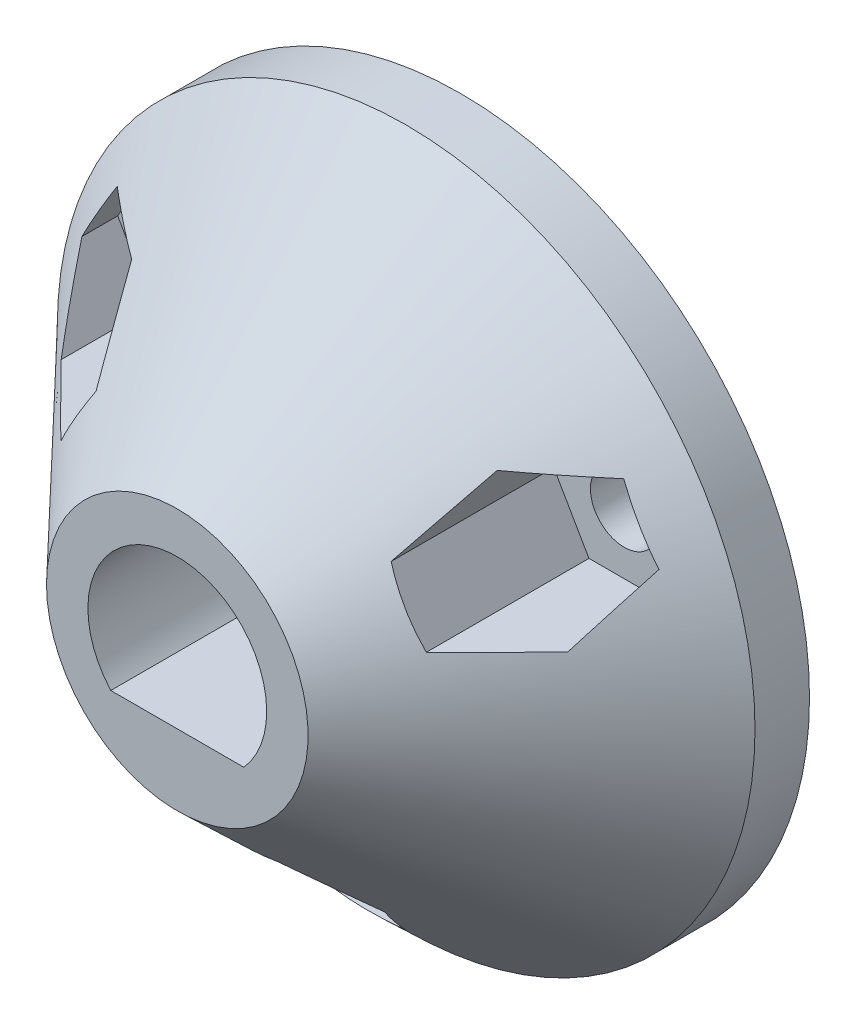
ISO-10303-21;
HEADER;
FILE_DESCRIPTION(('STEP AP214'),'2;1');
FILE_NAME('part.step','',(''),(''),'','','');
FILE_SCHEMA(('AUTOMOTIVE_DESIGN { 1 0 10303 214 1 1 1 1 }'));
ENDSEC;
DATA;
#1=APPLICATION_CONTEXT('core data for automotive mechanical design processes');
#2=APPLICATION_PROTOCOL_DEFINITION('international standard','automotive_design',2000,#1);
#3=PRODUCT_CONTEXT('',#1,'mechanical');
#4=PRODUCT('Part','Part','',(#3));
#5=PRODUCT_RELATED_PRODUCT_CATEGORY('part','',(#4));
#6=PRODUCT_DEFINITION_FORMATION('','',#4);
#7=PRODUCT_DEFINITION_CONTEXT('part definition',#1,'design');
#8=PRODUCT_DEFINITION('design','',#6,#7);
#9=PRODUCT_DEFINITION_SHAPE('','',#8);
#10=(LENGTH_UNIT() NAMED_UNIT(*) SI_UNIT(.MILLI.,.METRE.));
#11=(NAMED_UNIT(*) PLANE_ANGLE_UNIT() SI_UNIT($,.RADIAN.));
#12=(NAMED_UNIT(*) SI_UNIT($,.STERADIAN.) SOLID_ANGLE_UNIT());
#13=UNCERTAINTY_MEASURE_WITH_UNIT(LENGTH_MEASURE(1.E-05),#10,'distance_accuracy_value','');
#14=(GEOMETRIC_REPRESENTATION_CONTEXT(3) GLOBAL_UNCERTAINTY_ASSIGNED_CONTEXT((#13)) GLOBAL_UNIT_ASSIGNED_CONTEXT((#10,
#11,#12)) REPRESENTATION_CONTEXT('',''));
#15=CARTESIAN_POINT('',(0.,0.,0.));
#16=DIRECTION('',(0.,0.,1.));
#17=DIRECTION('',(1.,0.,0.));
#18=AXIS2_PLACEMENT_3D('',#15,#16,#17);
#19=CARTESIAN_POINT('',(0.,0.,1.25));
#20=DIRECTION('',(0.,0.,1.));
#21=DIRECTION('',(1.,0.,0.));
#22=AXIS2_PLACEMENT_3D('',#19,#20,#21);
#23=CYLINDRICAL_SURFACE('',#22,16.);
#24=CARTESIAN_POINT('',(0.,0.,2.5));
#25=DIRECTION('',(0.,0.,1.));
#26=DIRECTION('',(1.,0.,0.));
#27=AXIS2_PLACEMENT_3D('',#24,#25,#26);
#28=CIRCLE('',#27,16.);
#29=CARTESIAN_POINT('',(-16.,0.,2.5));
#30=VERTEX_POINT('',#29);
#31=EDGE_CURVE('E494',#30,#30,#28,.T.);
#32=ORIENTED_EDGE('',*,*,#31,.F.);
#33=DIRECTION('',(0.,0.,-1.));
#34=VECTOR('',#33,1.);
#35=CARTESIAN_POINT('',(-16.,0.,1.25));
#36=LINE('',#35,#34);
#37=CARTESIAN_POINT('',(-16.,0.,0.));
#38=VERTEX_POINT('',#37);
#39=EDGE_CURVE('E10',#30,#38,#36,.T.);
#40=ORIENTED_EDGE('',*,*,#39,.T.);
#41=CARTESIAN_POINT('',(0.,0.,0.));
#42=DIRECTION('',(0.,0.,1.));
#43=DIRECTION('',(1.,0.,0.));
#44=AXIS2_PLACEMENT_3D('',#41,#42,#43);
#45=CIRCLE('',#44,16.);
#46=EDGE_CURVE('E20',#38,#38,#45,.T.);
#47=ORIENTED_EDGE('',*,*,#46,.T.);
#48=ORIENTED_EDGE('',*,*,#39,.F.);
#49=EDGE_LOOP('',(#32,#40,#47,#48));
#50=FACE_BOUND('',#49,.T.);
#51=ADVANCED_FACE('F16',(#50),#23,.T.);
#52=CARTESIAN_POINT('',(16.,0.,0.));
#53=DIRECTION('',(0.,0.,-1.));
#54=DIRECTION('',(0.,-1.,0.));
#55=AXIS2_PLACEMENT_3D('',#52,#53,#54);
#56=PLANE('',#55);
#57=CARTESIAN_POINT('',(-10.,5.77350269189625,0.));
#58=DIRECTION('',(0.,0.,1.));
#59=DIRECTION('',(1.,0.,0.));
#60=AXIS2_PLACEMENT_3D('',#57,#58,#59);
#61=CIRCLE('',#60,1.55);
#62=CARTESIAN_POINT('',(-11.55,5.77350269189625,0.));
#63=VERTEX_POINT('',#62);
#64=EDGE_CURVE('E293',#63,#63,#61,.T.);
#65=ORIENTED_EDGE('',*,*,#64,.T.);
#66=EDGE_LOOP('',(#65));
#67=FACE_BOUND('',#66,.T.);
#68=CARTESIAN_POINT('',(10.,5.77350269189625,0.));
#69=DIRECTION('',(0.,0.,1.));
#70=DIRECTION('',(1.,0.,0.));
#71=AXIS2_PLACEMENT_3D('',#68,#69,#70);
#72=CIRCLE('',#71,1.55);
#73=CARTESIAN_POINT('',(8.45,5.77350269189625,0.));
#74=VERTEX_POINT('',#73);
#75=EDGE_CURVE('E294',#74,#74,#72,.T.);
#76=ORIENTED_EDGE('',*,*,#75,.T.);
#77=EDGE_LOOP('',(#76));
#78=FACE_BOUND('',#77,.T.);
#79=CARTESIAN_POINT('',(0.,-11.5470053837925,0.));
#80=DIRECTION('',(0.,0.,1.));
#81=DIRECTION('',(1.,0.,0.));
#82=AXIS2_PLACEMENT_3D('',#79,#80,#81);
#83=CIRCLE('',#82,1.55);
#84=CARTESIAN_POINT('',(-1.55,-11.5470053837925,0.));
#85=VERTEX_POINT('',#84);
#86=EDGE_CURVE('E474',#85,#85,#83,.T.);
#87=ORIENTED_EDGE('',*,*,#86,.T.);
#88=EDGE_LOOP('',(#87));
#89=FACE_BOUND('',#88,.T.);
#90=CARTESIAN_POINT('',(0.,0.,0.));
#91=DIRECTION('',(0.,0.,1.));
#92=DIRECTION('',(-1.,0.,0.));
#93=AXIS2_PLACEMENT_3D('',#90,#91,#92);
#94=CIRCLE('',#93,4.1);
#95=CARTESIAN_POINT('',(3.05,-2.73998175176405,0.));
#96=VERTEX_POINT('',#95);
#97=CARTESIAN_POINT('',(-3.05,-2.73998175176405,0.));
#98=VERTEX_POINT('',#97);
#99=EDGE_CURVE('E522',#96,#98,#94,.T.);
#100=ORIENTED_EDGE('',*,*,#99,.T.);
#101=DIRECTION('',(1.,0.,0.));
#102=VECTOR('',#101,1.);
#103=CARTESIAN_POINT('',(9.525,-2.73998175176405,0.));
#104=LINE('',#103,#102);
#105=EDGE_CURVE('E523',#98,#96,#104,.T.);
#106=ORIENTED_EDGE('',*,*,#105,.T.);
#107=EDGE_LOOP('',(#100,#106));
#108=FACE_BOUND('',#107,.T.);
#109=ORIENTED_EDGE('',*,*,#46,.F.);
#110=EDGE_LOOP('',(#109));
#111=FACE_BOUND('',#110,.T.);
#112=ADVANCED_FACE('F18',(#67,#78,#89,#108,#111),#56,.T.);
#113=CARTESIAN_POINT('',(0.,0.,13.));
#114=DIRECTION('',(0.,0.,1.));
#115=DIRECTION('',(1.,0.,0.));
#116=AXIS2_PLACEMENT_3D('',#113,#114,#115);
#117=PLANE('',#116);
#118=CARTESIAN_POINT('',(0.,0.,13.));
#119=DIRECTION('',(0.,0.,-1.));
#120=DIRECTION('',(-1.,0.,0.));
#121=AXIS2_PLACEMENT_3D('',#118,#119,#120);
#122=CIRCLE('',#121,4.1);
#123=CARTESIAN_POINT('',(-3.05,-2.73998175176405,13.));
#124=VERTEX_POINT('',#123);
#125=CARTESIAN_POINT('',(3.05,-2.73998175176405,13.));
#126=VERTEX_POINT('',#125);
#127=EDGE_CURVE('E534',#124,#126,#122,.T.);
#128=ORIENTED_EDGE('',*,*,#127,.T.);
#129=DIRECTION('',(-1.,0.,0.));
#130=VECTOR('',#129,1.);
#131=CARTESIAN_POINT('',(1.525,-2.73998175176405,13.));
#132=LINE('',#131,#130);
#133=EDGE_CURVE('E574',#126,#124,#132,.T.);
#134=ORIENTED_EDGE('',*,*,#133,.T.);
#135=EDGE_LOOP('',(#128,#134));
#136=FACE_BOUND('',#135,.T.);
#137=CARTESIAN_POINT('',(0.,0.,13.));
#138=DIRECTION('',(0.,0.,1.));
#139=DIRECTION('',(1.,0.,0.));
#140=AXIS2_PLACEMENT_3D('',#137,#138,#139);
#141=CIRCLE('',#140,6.);
#142=CARTESIAN_POINT('',(-6.,0.,13.));
#143=VERTEX_POINT('',#142);
#144=EDGE_CURVE('E490',#143,#143,#141,.T.);
#145=ORIENTED_EDGE('',*,*,#144,.T.);
#146=EDGE_LOOP('',(#145));
#147=FACE_BOUND('',#146,.T.);
#148=ADVANCED_FACE('F504',(#136,#147),#117,.T.);
#149=CARTESIAN_POINT('',(0.,0.,7.75));
#150=DIRECTION('',(0.,0.,-1.));
#151=DIRECTION('',(1.,0.,0.));
#152=AXIS2_PLACEMENT_3D('',#149,#150,#151);
#153=CONICAL_SURFACE('',#152,11.,0.76101275422473);
#154=CARTESIAN_POINT('',(1.61658075373094,-8.74700538379252,9.96010766868991));
#155=CARTESIAN_POINT('',(2.30505807744167,-9.93948308831856,8.59747891233442));
#156=CARTESIAN_POINT('',(3.2331615074619,-11.5470053837925,6.70933679268643));
#157=(BOUNDED_CURVE() B_SPLINE_CURVE(2,(#154,#155,#156),.UNSPECIFIED.,.F.,
.F.) B_SPLINE_CURVE_WITH_KNOTS((3,3),(0.,0.537696241401946),
.UNSPECIFIED.) CURVE() GEOMETRIC_REPRESENTATION_ITEM() RATIONAL_B_SPLINE_CURVE((1.,
1.02388910913976,1.02322773113183)) REPRESENTATION_ITEM(''));
#158=CARTESIAN_POINT('',(1.61658075373094,-8.74700538379252,9.96010766868991));
#159=VERTEX_POINT('',#158);
#160=CARTESIAN_POINT('',(3.2331615074619,-11.5470053837925,6.70933679268642));
#161=VERTEX_POINT('',#160);
#162=EDGE_CURVE('E381',#159,#161,#157,.T.);
#163=ORIENTED_EDGE('',*,*,#162,.T.);
#164=CARTESIAN_POINT('',(3.2331615074619,-11.5470053837925,6.70933679268642));
#165=CARTESIAN_POINT('',(2.4996995492081,-12.8173987609071,5.63247798182419));
#166=CARTESIAN_POINT('',(1.61658075373094,-14.3470053837925,4.14031625529295));
#167=(BOUNDED_CURVE() B_SPLINE_CURVE(2,(#164,#165,#166),.UNSPECIFIED.,.F.,
.F.) B_SPLINE_CURVE_WITH_KNOTS((3,3),(0.,0.440695360359481),
.UNSPECIFIED.) CURVE() GEOMETRIC_REPRESENTATION_ITEM() RATIONAL_B_SPLINE_CURVE((1.,
1.01142532640549,1.00767157793765)) REPRESENTATION_ITEM(''));
#168=CARTESIAN_POINT('',(1.61658075373094,-14.3470053837925,4.14031625529295));
#169=VERTEX_POINT('',#168);
#170=EDGE_CURVE('E405',#161,#169,#167,.T.);
#171=ORIENTED_EDGE('',*,*,#170,.T.);
#172=CARTESIAN_POINT('',(1.61658075373094,-14.3470053837925,4.14031625529295));
#173=CARTESIAN_POINT('',(0.,-14.3470053837925,4.3303729905468));
#174=CARTESIAN_POINT('',(-1.61658075373096,-14.3470053837925,4.14031625529295));
#175=(BOUNDED_CURVE() B_SPLINE_CURVE(2,(#172,#173,#174),.UNSPECIFIED.,.F.,
.F.) B_SPLINE_CURVE_WITH_KNOTS((3,3),(0.553743640340846,0.904692478476342),
.UNSPECIFIED.) CURVE() GEOMETRIC_REPRESENTATION_ITEM() RATIONAL_B_SPLINE_CURVE((1.05427190699792,
1.06094339905297,1.05427190699792)) REPRESENTATION_ITEM(''));
#176=CARTESIAN_POINT('',(-1.61658075373096,-14.3470053837925,4.14031625529295));
#177=VERTEX_POINT('',#176);
#178=EDGE_CURVE('E410',#169,#177,#175,.T.);
#179=ORIENTED_EDGE('',*,*,#178,.T.);
#180=CARTESIAN_POINT('',(-1.61658075373096,-14.3470053837925,4.14031625529295));
#181=CARTESIAN_POINT('',(-2.49969954920809,-12.8173987609071,5.63247798182414));
#182=CARTESIAN_POINT('',(-3.23316150746192,-11.5470053837925,6.70933679268641));
#183=(BOUNDED_CURVE() B_SPLINE_CURVE(2,(#180,#181,#182),.UNSPECIFIED.,.F.,
.F.) B_SPLINE_CURVE_WITH_KNOTS((3,3),(0.222729568960565,0.663424929320055),
.UNSPECIFIED.) CURVE() GEOMETRIC_REPRESENTATION_ITEM() RATIONAL_B_SPLINE_CURVE((1.0076715779377,
1.01142532640557,1.)) REPRESENTATION_ITEM(''));
#184=CARTESIAN_POINT('',(-3.23316150746191,-11.5470053837925,6.70933679268641));
#185=VERTEX_POINT('',#184);
#186=EDGE_CURVE('E436',#177,#185,#183,.T.);
#187=ORIENTED_EDGE('',*,*,#186,.T.);
#188=CARTESIAN_POINT('',(-3.23316150746192,-11.5470053837925,6.70933679268641));
#189=CARTESIAN_POINT('',(-2.30505807744156,-9.93948308831832,8.59747891233468));
#190=CARTESIAN_POINT('',(-1.61658075373096,-8.74700538379252,9.9601076686899));
#191=(BOUNDED_CURVE() B_SPLINE_CURVE(2,(#188,#189,#190),.UNSPECIFIED.,.F.,
.F.) B_SPLINE_CURVE_WITH_KNOTS((3,3),(0.508725698628548,1.04642194003054),
.UNSPECIFIED.) CURVE() GEOMETRIC_REPRESENTATION_ITEM() RATIONAL_B_SPLINE_CURVE((1.0232277311318,
1.02388910913973,1.)) REPRESENTATION_ITEM(''));
#192=CARTESIAN_POINT('',(-1.61658075373096,-8.74700538379252,9.9601076686899));
#193=VERTEX_POINT('',#192);
#194=EDGE_CURVE('E386',#185,#193,#191,.T.);
#195=ORIENTED_EDGE('',*,*,#194,.T.);
#196=CARTESIAN_POINT('',(-1.61658075373096,-8.74700538379252,9.9601076686899));
#197=CARTESIAN_POINT('',(0.,-8.74700538379252,10.2685908821785));
#198=CARTESIAN_POINT('',(1.61658075373094,-8.74700538379252,9.9601076686899));
#199=(BOUNDED_CURVE() B_SPLINE_CURVE(2,(#196,#197,#198),.UNSPECIFIED.,.F.,
.F.) B_SPLINE_CURVE_WITH_KNOTS((3,3),(1.28022715089787,1.80190156566261),
.UNSPECIFIED.) CURVE() GEOMETRIC_REPRESENTATION_ITEM() RATIONAL_B_SPLINE_CURVE((1.40272121572847,
1.42647624076866,1.40272121572847)) REPRESENTATION_ITEM(''));
#200=EDGE_CURVE('E397',#193,#159,#199,.T.);
#201=ORIENTED_EDGE('',*,*,#200,.T.);
#202=EDGE_LOOP('',(#163,#171,#179,#187,#195,#201));
#203=FACE_BOUND('',#202,.T.);
#204=CARTESIAN_POINT('',(6.76683849253811,5.77350269189625,9.96010766868991));
#205=CARTESIAN_POINT('',(7.45531581624866,6.96598039642199,8.59747891233479));
#206=CARTESIAN_POINT('',(8.38341924626907,8.57350269189625,6.70933679268641));
#207=(BOUNDED_CURVE() B_SPLINE_CURVE(2,(#204,#205,#206),.UNSPECIFIED.,.F.,
.F.) B_SPLINE_CURVE_WITH_KNOTS((3,3),(0.,0.537696241402132),
.UNSPECIFIED.) CURVE() GEOMETRIC_REPRESENTATION_ITEM() RATIONAL_B_SPLINE_CURVE((1.,
1.02388910914005,1.02322773113211)) REPRESENTATION_ITEM(''));
#208=CARTESIAN_POINT('',(6.76683849253811,5.77350269189625,9.96010766868991));
#209=VERTEX_POINT('',#208);
#210=CARTESIAN_POINT('',(8.38341924626906,8.57350269189625,6.70933679268641));
#211=VERTEX_POINT('',#210);
#212=EDGE_CURVE('E289',#209,#211,#207,.T.);
#213=ORIENTED_EDGE('',*,*,#212,.T.);
#214=CARTESIAN_POINT('',(8.38341924626906,8.57350269189625,6.70933679268641));
#215=CARTESIAN_POINT('',(9.8503431627767,8.57350269189625,5.63247798182414));
#216=CARTESIAN_POINT('',(11.616580753731,8.57350269189626,4.14031625529295));
#217=(BOUNDED_CURVE() B_SPLINE_CURVE(2,(#214,#215,#216),.UNSPECIFIED.,.F.,
.F.) B_SPLINE_CURVE_WITH_KNOTS((3,3),(0.,0.440695360359477),
.UNSPECIFIED.) CURVE() GEOMETRIC_REPRESENTATION_ITEM() RATIONAL_B_SPLINE_CURVE((1.,
1.0114253264055,1.00767157793765)) REPRESENTATION_ITEM(''));
#218=CARTESIAN_POINT('',(11.616580753731,8.57350269189625,4.14031625529295));
#219=VERTEX_POINT('',#218);
#220=EDGE_CURVE('E312',#211,#219,#217,.T.);
#221=ORIENTED_EDGE('',*,*,#220,.T.);
#222=CARTESIAN_POINT('',(11.616580753731,8.57350269189625,4.14031625529295));
#223=CARTESIAN_POINT('',(12.4248711305964,7.17350269189625,4.3303729905468));
#224=CARTESIAN_POINT('',(13.2331615074619,5.77350269189626,4.14031625529295));
#225=(BOUNDED_CURVE() B_SPLINE_CURVE(2,(#222,#223,#224),.UNSPECIFIED.,.F.,
.F.) B_SPLINE_CURVE_WITH_KNOTS((3,3),(0.553743640340845,0.904692478476342),
.UNSPECIFIED.) CURVE() GEOMETRIC_REPRESENTATION_ITEM() RATIONAL_B_SPLINE_CURVE((1.05427190699792,
1.06094339905297,1.05427190699792)) REPRESENTATION_ITEM(''));
#226=CARTESIAN_POINT('',(13.2331615074619,5.77350269189625,4.14031625529295));
#227=VERTEX_POINT('',#226);
#228=EDGE_CURVE('E329',#219,#227,#225,.T.);
#229=ORIENTED_EDGE('',*,*,#228,.T.);
#230=CARTESIAN_POINT('',(13.2331615074619,5.77350269189625,4.14031625529295));
#231=CARTESIAN_POINT('',(12.3500427119848,4.24389606901077,5.6324779818242));
#232=CARTESIAN_POINT('',(11.616580753731,2.97350269189625,6.70933679268641));
#233=(BOUNDED_CURVE() B_SPLINE_CURVE(2,(#230,#231,#232),.UNSPECIFIED.,.F.,
.F.) B_SPLINE_CURVE_WITH_KNOTS((3,3),(0.222729568960564,0.663424929320054),
.UNSPECIFIED.) CURVE() GEOMETRIC_REPRESENTATION_ITEM() RATIONAL_B_SPLINE_CURVE((1.00767157793767,
1.01142532640552,1.)) REPRESENTATION_ITEM(''));
#234=CARTESIAN_POINT('',(11.616580753731,2.97350269189625,6.70933679268641));
#235=VERTEX_POINT('',#234);
#236=EDGE_CURVE('E268',#227,#235,#233,.T.);
#237=ORIENTED_EDGE('',*,*,#236,.T.);
#238=CARTESIAN_POINT('',(11.616580753731,2.97350269189625,6.70933679268641));
#239=CARTESIAN_POINT('',(9.76037389369042,2.97350269189625,8.59747891233452));
#240=CARTESIAN_POINT('',(8.38341924626906,2.97350269189625,9.9601076686899));
#241=(BOUNDED_CURVE() B_SPLINE_CURVE(2,(#238,#239,#240),.UNSPECIFIED.,.F.,
.F.) B_SPLINE_CURVE_WITH_KNOTS((3,3),(0.508725698628593,1.04642194003054),
.UNSPECIFIED.) CURVE() GEOMETRIC_REPRESENTATION_ITEM() RATIONAL_B_SPLINE_CURVE((1.02322773113178,
1.0238891091397,1.)) REPRESENTATION_ITEM(''));
#242=CARTESIAN_POINT('',(8.38341924626906,2.97350269189625,9.9601076686899));
#243=VERTEX_POINT('',#242);
#244=EDGE_CURVE('E354',#235,#243,#241,.T.);
#245=ORIENTED_EDGE('',*,*,#244,.T.);
#246=CARTESIAN_POINT('',(8.38341924626907,2.97350269189625,9.9601076686899));
#247=CARTESIAN_POINT('',(7.57512886940357,4.37350269189625,10.2685908821785));
#248=CARTESIAN_POINT('',(6.76683849253811,5.77350269189625,9.9601076686899));
#249=(BOUNDED_CURVE() B_SPLINE_CURVE(2,(#246,#247,#248),.UNSPECIFIED.,.F.,
.F.) B_SPLINE_CURVE_WITH_KNOTS((3,3),(1.28022715089787,1.80190156566261),
.UNSPECIFIED.) CURVE() GEOMETRIC_REPRESENTATION_ITEM() RATIONAL_B_SPLINE_CURVE((1.40272121572847,
1.42647624076866,1.40272121572847)) REPRESENTATION_ITEM(''));
#250=EDGE_CURVE('E343',#243,#209,#249,.T.);
#251=ORIENTED_EDGE('',*,*,#250,.T.);
#252=EDGE_LOOP('',(#213,#221,#229,#237,#245,#251));
#253=FACE_BOUND('',#252,.T.);
#254=CARTESIAN_POINT('',(-8.38341924626905,2.97350269189627,9.96010766868991));
#255=CARTESIAN_POINT('',(-9.76037389369004,2.97350269189627,8.5974789123349));
#256=CARTESIAN_POINT('',(-11.616580753731,2.97350269189627,6.70933679268641));
#257=(BOUNDED_CURVE() B_SPLINE_CURVE(2,(#254,#255,#256),.UNSPECIFIED.,.F.,
.F.) B_SPLINE_CURVE_WITH_KNOTS((3,3),(0.,0.537696241402152),
.UNSPECIFIED.) CURVE() GEOMETRIC_REPRESENTATION_ITEM() RATIONAL_B_SPLINE_CURVE((1.,
1.02388910914004,1.02322773113209)) REPRESENTATION_ITEM(''));
#258=CARTESIAN_POINT('',(-8.38341924626905,2.97350269189627,9.96010766868991));
#259=VERTEX_POINT('',#258);
#260=CARTESIAN_POINT('',(-11.616580753731,2.97350269189627,6.70933679268641));
#261=VERTEX_POINT('',#260);
#262=EDGE_CURVE('E577',#259,#261,#257,.T.);
#263=ORIENTED_EDGE('',*,*,#262,.T.);
#264=CARTESIAN_POINT('',(-11.616580753731,2.97350269189627,6.70933679268642));
#265=CARTESIAN_POINT('',(-12.3500427119848,4.24389606901085,5.63247798182415));
#266=CARTESIAN_POINT('',(-13.2331615074619,5.77350269189627,4.14031625529295));
#267=(BOUNDED_CURVE() B_SPLINE_CURVE(2,(#264,#265,#266),.UNSPECIFIED.,.F.,
.F.) B_SPLINE_CURVE_WITH_KNOTS((3,3),(0.,0.44069536035948),
.UNSPECIFIED.) CURVE() GEOMETRIC_REPRESENTATION_ITEM() RATIONAL_B_SPLINE_CURVE((1.,
1.0114253264055,1.00767157793766)) REPRESENTATION_ITEM(''));
#268=CARTESIAN_POINT('',(-13.2331615074619,5.77350269189627,4.14031625529295));
#269=VERTEX_POINT('',#268);
#270=EDGE_CURVE('E552',#261,#269,#267,.T.);
#271=ORIENTED_EDGE('',*,*,#270,.T.);
#272=CARTESIAN_POINT('',(-13.2331615074619,5.77350269189627,4.14031625529295));
#273=CARTESIAN_POINT('',(-12.4248711305964,7.17350269189628,4.3303729905468));
#274=CARTESIAN_POINT('',(-11.6165807537309,8.57350269189627,4.14031625529295));
#275=(BOUNDED_CURVE() B_SPLINE_CURVE(2,(#272,#273,#274),.UNSPECIFIED.,.F.,
.F.) B_SPLINE_CURVE_WITH_KNOTS((3,3),(0.553743640340846,0.904692478476342),
.UNSPECIFIED.) CURVE() GEOMETRIC_REPRESENTATION_ITEM() RATIONAL_B_SPLINE_CURVE((1.05427190699792,
1.06094339905297,1.05427190699792)) REPRESENTATION_ITEM(''));
#276=CARTESIAN_POINT('',(-11.6165807537309,8.57350269189627,4.14031625529295));
#277=VERTEX_POINT('',#276);
#278=EDGE_CURVE('E578',#269,#277,#275,.T.);
#279=ORIENTED_EDGE('',*,*,#278,.T.);
#280=CARTESIAN_POINT('',(-11.6165807537309,8.57350269189627,4.14031625529295));
#281=CARTESIAN_POINT('',(-9.85034316277659,8.57350269189627,5.63247798182422));
#282=CARTESIAN_POINT('',(-8.38341924626904,8.57350269189627,6.70933679268641));
#283=(BOUNDED_CURVE() B_SPLINE_CURVE(2,(#280,#281,#282),.UNSPECIFIED.,.F.,
.F.) B_SPLINE_CURVE_WITH_KNOTS((3,3),(0.222729568960568,0.663424929320054),
.UNSPECIFIED.) CURVE() GEOMETRIC_REPRESENTATION_ITEM() RATIONAL_B_SPLINE_CURVE((1.00767157793765,
1.01142532640549,1.)) REPRESENTATION_ITEM(''));
#284=CARTESIAN_POINT('',(-8.38341924626904,8.57350269189627,6.70933679268641));
#285=VERTEX_POINT('',#284);
#286=EDGE_CURVE('E618',#277,#285,#283,.T.);
#287=ORIENTED_EDGE('',*,*,#286,.T.);
#288=CARTESIAN_POINT('',(-8.38341924626904,8.57350269189629,6.70933679268641));
#289=CARTESIAN_POINT('',(-7.45531581624862,6.96598039642195,8.59747891233483));
#290=CARTESIAN_POINT('',(-6.76683849253809,5.77350269189627,9.9601076686899));
#291=(BOUNDED_CURVE() B_SPLINE_CURVE(2,(#288,#289,#290),.UNSPECIFIED.,.F.,
.F.) B_SPLINE_CURVE_WITH_KNOTS((3,3),(0.508725698628429,1.04642194003054),
.UNSPECIFIED.) CURVE() GEOMETRIC_REPRESENTATION_ITEM() RATIONAL_B_SPLINE_CURVE((1.02322773113202,
1.02388910913997,1.)) REPRESENTATION_ITEM(''));
#292=CARTESIAN_POINT('',(-6.76683849253809,5.77350269189627,9.9601076686899));
#293=VERTEX_POINT('',#292);
#294=EDGE_CURVE('E258',#285,#293,#291,.T.);
#295=ORIENTED_EDGE('',*,*,#294,.T.);
#296=CARTESIAN_POINT('',(-6.76683849253809,5.77350269189627,9.9601076686899));
#297=CARTESIAN_POINT('',(-7.57512886940357,4.37350269189627,10.2685908821785));
#298=CARTESIAN_POINT('',(-8.38341924626905,2.97350269189627,9.9601076686899));
#299=(BOUNDED_CURVE() B_SPLINE_CURVE(2,(#296,#297,#298),.UNSPECIFIED.,.F.,
.F.) B_SPLINE_CURVE_WITH_KNOTS((3,3),(1.28022715089787,1.80190156566261),
.UNSPECIFIED.) CURVE() GEOMETRIC_REPRESENTATION_ITEM() RATIONAL_B_SPLINE_CURVE((1.40272121572847,
1.42647624076866,1.40272121572847)) REPRESENTATION_ITEM(''));
#300=EDGE_CURVE('E244',#293,#259,#299,.T.);
#301=ORIENTED_EDGE('',*,*,#300,.T.);
#302=EDGE_LOOP('',(#263,#271,#279,#287,#295,#301));
#303=FACE_BOUND('',#302,.T.);
#304=ORIENTED_EDGE('',*,*,#144,.F.);
#305=DIRECTION('',(-0.689655172413793,0.,-0.724137931034483));
#306=VECTOR('',#305,1.);
#307=CARTESIAN_POINT('',(-11.,0.,7.75));
#308=LINE('',#307,#306);
#309=EDGE_CURVE('E491',#143,#30,#308,.T.);
#310=ORIENTED_EDGE('',*,*,#309,.T.);
#311=ORIENTED_EDGE('',*,*,#31,.T.);
#312=ORIENTED_EDGE('',*,*,#309,.F.);
#313=EDGE_LOOP('',(#304,#310,#311,#312));
#314=FACE_BOUND('',#313,.T.);
#315=ADVANCED_FACE('F511',(#203,#253,#303,#314),#153,.T.);
#316=CARTESIAN_POINT('',(-10.,5.77350269189625,0.));
#317=DIRECTION('',(0.,0.,1.));
#318=DIRECTION('',(1.,0.,0.));
#319=AXIS2_PLACEMENT_3D('',#316,#317,#318);
#320=CYLINDRICAL_SURFACE('',#319,1.55);
#321=ORIENTED_EDGE('',*,*,#64,.F.);
#322=DIRECTION('',(0.,0.,1.));
#323=VECTOR('',#322,1.);
#324=CARTESIAN_POINT('',(-11.55,5.77350269189625,0.));
#325=LINE('',#324,#323);
#326=CARTESIAN_POINT('',(-11.55,5.77350269189625,2.5));
#327=VERTEX_POINT('',#326);
#328=EDGE_CURVE('E487',#63,#327,#325,.T.);
#329=ORIENTED_EDGE('',*,*,#328,.T.);
#330=CARTESIAN_POINT('',(-10.,5.77350269189625,2.5));
#331=DIRECTION('',(0.,0.,1.));
#332=DIRECTION('',(1.,0.,0.));
#333=AXIS2_PLACEMENT_3D('',#330,#331,#332);
#334=CIRCLE('',#333,1.55);
#335=EDGE_CURVE('E243',#327,#327,#334,.T.);
#336=ORIENTED_EDGE('',*,*,#335,.T.);
#337=ORIENTED_EDGE('',*,*,#328,.F.);
#338=EDGE_LOOP('',(#321,#329,#336,#337));
#339=FACE_BOUND('',#338,.T.);
#340=ADVANCED_FACE('F642',(#339),#320,.F.);
#341=CARTESIAN_POINT('',(10.,5.77350269189625,0.));
#342=DIRECTION('',(0.,0.,1.));
#343=DIRECTION('',(1.,0.,0.));
#344=AXIS2_PLACEMENT_3D('',#341,#342,#343);
#345=CYLINDRICAL_SURFACE('',#344,1.55);
#346=ORIENTED_EDGE('',*,*,#75,.F.);
#347=DIRECTION('',(0.,0.,1.));
#348=VECTOR('',#347,1.);
#349=CARTESIAN_POINT('',(8.45,5.77350269189625,0.));
#350=LINE('',#349,#348);
#351=CARTESIAN_POINT('',(8.45,5.77350269189625,2.5));
#352=VERTEX_POINT('',#351);
#353=EDGE_CURVE('E290',#74,#352,#350,.T.);
#354=ORIENTED_EDGE('',*,*,#353,.T.);
#355=CARTESIAN_POINT('',(10.,5.77350269189625,2.5));
#356=DIRECTION('',(0.,0.,1.));
#357=DIRECTION('',(1.,0.,0.));
#358=AXIS2_PLACEMENT_3D('',#355,#356,#357);
#359=CIRCLE('',#358,1.55);
#360=EDGE_CURVE('E342',#352,#352,#359,.T.);
#361=ORIENTED_EDGE('',*,*,#360,.T.);
#362=ORIENTED_EDGE('',*,*,#353,.F.);
#363=EDGE_LOOP('',(#346,#354,#361,#362));
#364=FACE_BOUND('',#363,.T.);
#365=ADVANCED_FACE('F650',(#364),#345,.F.);
#366=CARTESIAN_POINT('',(0.,-11.5470053837925,0.));
#367=DIRECTION('',(0.,0.,1.));
#368=DIRECTION('',(1.,0.,0.));
#369=AXIS2_PLACEMENT_3D('',#366,#367,#368);
#370=CYLINDRICAL_SURFACE('',#369,1.55);
#371=ORIENTED_EDGE('',*,*,#86,.F.);
#372=DIRECTION('',(0.,0.,1.));
#373=VECTOR('',#372,1.);
#374=CARTESIAN_POINT('',(-1.55,-11.5470053837925,0.));
#375=LINE('',#374,#373);
#376=CARTESIAN_POINT('',(-1.55,-11.5470053837925,2.5));
#377=VERTEX_POINT('',#376);
#378=EDGE_CURVE('E478',#85,#377,#375,.T.);
#379=ORIENTED_EDGE('',*,*,#378,.T.);
#380=CARTESIAN_POINT('',(0.,-11.5470053837925,2.5));
#381=DIRECTION('',(0.,0.,1.));
#382=DIRECTION('',(1.,0.,0.));
#383=AXIS2_PLACEMENT_3D('',#380,#381,#382);
#384=CIRCLE('',#383,1.55);
#385=EDGE_CURVE('E396',#377,#377,#384,.T.);
#386=ORIENTED_EDGE('',*,*,#385,.T.);
#387=ORIENTED_EDGE('',*,*,#378,.F.);
#388=EDGE_LOOP('',(#371,#379,#386,#387));
#389=FACE_BOUND('',#388,.T.);
#390=ADVANCED_FACE('F658',(#389),#370,.F.);
#391=CARTESIAN_POINT('',(0.,-11.5470053837925,2.5));
#392=DIRECTION('',(0.,0.,-1.));
#393=DIRECTION('',(0.,-1.,0.));
#394=AXIS2_PLACEMENT_3D('',#391,#392,#393);
#395=PLANE('',#394);
#396=ORIENTED_EDGE('',*,*,#385,.F.);
#397=EDGE_LOOP('',(#396));
#398=FACE_BOUND('',#397,.T.);
#399=DIRECTION('',(-1.,0.,0.));
#400=VECTOR('',#399,1.);
#401=CARTESIAN_POINT('',(1.61658075373095,-14.3470053837925,2.5));
#402=LINE('',#401,#400);
#403=CARTESIAN_POINT('',(1.61658075373095,-14.3470053837925,2.5));
#404=VERTEX_POINT('',#403);
#405=CARTESIAN_POINT('',(-1.61658075373096,-14.3470053837925,2.5));
#406=VERTEX_POINT('',#405);
#407=EDGE_CURVE('E428',#404,#406,#402,.T.);
#408=ORIENTED_EDGE('',*,*,#407,.F.);
#409=DIRECTION('',(-0.5,-0.866025403784439,0.));
#410=VECTOR('',#409,1.);
#411=CARTESIAN_POINT('',(3.2331615074619,-11.5470053837925,2.5));
#412=LINE('',#411,#410);
#413=CARTESIAN_POINT('',(3.2331615074619,-11.5470053837925,2.5));
#414=VERTEX_POINT('',#413);
#415=EDGE_CURVE('E411',#414,#404,#412,.T.);
#416=ORIENTED_EDGE('',*,*,#415,.F.);
#417=DIRECTION('',(0.5,-0.866025403784439,0.));
#418=VECTOR('',#417,1.);
#419=CARTESIAN_POINT('',(1.61658075373094,-8.74700538379252,2.5));
#420=LINE('',#419,#418);
#421=CARTESIAN_POINT('',(1.61658075373094,-8.74700538379252,2.5));
#422=VERTEX_POINT('',#421);
#423=EDGE_CURVE('E392',#422,#414,#420,.T.);
#424=ORIENTED_EDGE('',*,*,#423,.F.);
#425=DIRECTION('',(1.,0.,0.));
#426=VECTOR('',#425,1.);
#427=CARTESIAN_POINT('',(-1.61658075373096,-8.74700538379252,2.5));
#428=LINE('',#427,#426);
#429=CARTESIAN_POINT('',(-1.61658075373096,-8.74700538379252,2.5));
#430=VERTEX_POINT('',#429);
#431=EDGE_CURVE('E393',#430,#422,#428,.T.);
#432=ORIENTED_EDGE('',*,*,#431,.F.);
#433=DIRECTION('',(0.5,0.866025403784439,0.));
#434=VECTOR('',#433,1.);
#435=CARTESIAN_POINT('',(-3.23316150746191,-11.5470053837925,2.5));
#436=LINE('',#435,#434);
#437=CARTESIAN_POINT('',(-3.23316150746191,-11.5470053837925,2.5));
#438=VERTEX_POINT('',#437);
#439=EDGE_CURVE('E442',#438,#430,#436,.T.);
#440=ORIENTED_EDGE('',*,*,#439,.F.);
#441=DIRECTION('',(-0.5,0.866025403784439,0.));
#442=VECTOR('',#441,1.);
#443=CARTESIAN_POINT('',(-1.61658075373096,-14.3470053837925,2.5));
#444=LINE('',#443,#442);
#445=EDGE_CURVE('E387',#406,#438,#444,.T.);
#446=ORIENTED_EDGE('',*,*,#445,.F.);
#447=EDGE_LOOP('',(#408,#416,#424,#432,#440,#446));
#448=FACE_BOUND('',#447,.T.);
#449=ADVANCED_FACE('F662',(#398,#448),#395,.F.);
#450=CARTESIAN_POINT('',(1.61658075373094,-8.74700538379252,2.5));
#451=DIRECTION('',(0.,1.,0.));
#452=DIRECTION('',(1.,0.,0.));
#453=AXIS2_PLACEMENT_3D('',#450,#451,#452);
#454=PLANE('',#453);
#455=ORIENTED_EDGE('',*,*,#200,.F.);
#456=DIRECTION('',(0.,0.,1.));
#457=VECTOR('',#456,1.);
#458=CARTESIAN_POINT('',(-1.61658075373096,-8.74700538379252,2.5));
#459=LINE('',#458,#457);
#460=EDGE_CURVE('E449',#430,#193,#459,.T.);
#461=ORIENTED_EDGE('',*,*,#460,.F.);
#462=ORIENTED_EDGE('',*,*,#431,.T.);
#463=DIRECTION('',(0.,0.,1.));
#464=VECTOR('',#463,1.);
#465=CARTESIAN_POINT('',(1.61658075373094,-8.74700538379252,2.5));
#466=LINE('',#465,#464);
#467=EDGE_CURVE('E388',#422,#159,#466,.T.);
#468=ORIENTED_EDGE('',*,*,#467,.T.);
#469=EDGE_LOOP('',(#455,#461,#462,#468));
#470=FACE_BOUND('',#469,.T.);
#471=ADVANCED_FACE('F664',(#470),#454,.F.);
#472=CARTESIAN_POINT('',(-1.61658075373096,-8.74700538379252,2.5));
#473=DIRECTION('',(-0.866025403784439,0.5,0.));
#474=DIRECTION('',(0.,0.,1.));
#475=AXIS2_PLACEMENT_3D('',#472,#473,#474);
#476=PLANE('',#475);
#477=ORIENTED_EDGE('',*,*,#194,.F.);
#478=DIRECTION('',(0.,0.,1.));
#479=VECTOR('',#478,1.);
#480=CARTESIAN_POINT('',(-3.23316150746191,-11.5470053837925,2.5));
#481=LINE('',#480,#479);
#482=EDGE_CURVE('E382',#438,#185,#481,.T.);
#483=ORIENTED_EDGE('',*,*,#482,.F.);
#484=ORIENTED_EDGE('',*,*,#439,.T.);
#485=ORIENTED_EDGE('',*,*,#460,.T.);
#486=EDGE_LOOP('',(#477,#483,#484,#485));
#487=FACE_BOUND('',#486,.T.);
#488=ADVANCED_FACE('F667',(#487),#476,.F.);
#489=CARTESIAN_POINT('',(-3.23316150746191,-11.5470053837925,2.5));
#490=DIRECTION('',(-0.866025403784439,-0.5,0.));
#491=DIRECTION('',(-0.5,0.866025403784439,0.));
#492=AXIS2_PLACEMENT_3D('',#489,#490,#491);
#493=PLANE('',#492);
#494=ORIENTED_EDGE('',*,*,#186,.F.);
#495=DIRECTION('',(0.,0.,1.));
#496=VECTOR('',#495,1.);
#497=CARTESIAN_POINT('',(-1.61658075373096,-14.3470053837925,2.5));
#498=LINE('',#497,#496);
#499=EDGE_CURVE('E435',#406,#177,#498,.T.);
#500=ORIENTED_EDGE('',*,*,#499,.F.);
#501=ORIENTED_EDGE('',*,*,#445,.T.);
#502=ORIENTED_EDGE('',*,*,#482,.T.);
#503=EDGE_LOOP('',(#494,#500,#501,#502));
#504=FACE_BOUND('',#503,.T.);
#505=ADVANCED_FACE('F671',(#504),#493,.F.);
#506=CARTESIAN_POINT('',(-1.61658075373096,-14.3470053837925,2.5));
#507=DIRECTION('',(0.,-1.,0.));
#508=DIRECTION('',(0.,0.,-1.));
#509=AXIS2_PLACEMENT_3D('',#506,#507,#508);
#510=PLANE('',#509);
#511=ORIENTED_EDGE('',*,*,#178,.F.);
#512=DIRECTION('',(0.,0.,1.));
#513=VECTOR('',#512,1.);
#514=CARTESIAN_POINT('',(1.61658075373095,-14.3470053837925,2.5));
#515=LINE('',#514,#513);
#516=EDGE_CURVE('E406',#404,#169,#515,.T.);
#517=ORIENTED_EDGE('',*,*,#516,.F.);
#518=ORIENTED_EDGE('',*,*,#407,.T.);
#519=ORIENTED_EDGE('',*,*,#499,.T.);
#520=EDGE_LOOP('',(#511,#517,#518,#519));
#521=FACE_BOUND('',#520,.T.);
#522=ADVANCED_FACE('F674',(#521),#510,.F.);
#523=CARTESIAN_POINT('',(1.61658075373095,-14.3470053837925,2.5));
#524=DIRECTION('',(0.866025403784439,-0.5,0.));
#525=DIRECTION('',(0.,0.,-1.));
#526=AXIS2_PLACEMENT_3D('',#523,#524,#525);
#527=PLANE('',#526);
#528=ORIENTED_EDGE('',*,*,#170,.F.);
#529=DIRECTION('',(0.,0.,1.));
#530=VECTOR('',#529,1.);
#531=CARTESIAN_POINT('',(3.2331615074619,-11.5470053837925,2.5));
#532=LINE('',#531,#530);
#533=EDGE_CURVE('E401',#414,#161,#532,.T.);
#534=ORIENTED_EDGE('',*,*,#533,.F.);
#535=ORIENTED_EDGE('',*,*,#415,.T.);
#536=ORIENTED_EDGE('',*,*,#516,.T.);
#537=EDGE_LOOP('',(#528,#534,#535,#536));
#538=FACE_BOUND('',#537,.T.);
#539=ADVANCED_FACE('F679',(#538),#527,.F.);
#540=CARTESIAN_POINT('',(3.2331615074619,-11.5470053837925,2.5));
#541=DIRECTION('',(0.866025403784439,0.5,0.));
#542=DIRECTION('',(0.,0.,-1.));
#543=AXIS2_PLACEMENT_3D('',#540,#541,#542);
#544=PLANE('',#543);
#545=ORIENTED_EDGE('',*,*,#162,.F.);
#546=ORIENTED_EDGE('',*,*,#467,.F.);
#547=ORIENTED_EDGE('',*,*,#423,.T.);
#548=ORIENTED_EDGE('',*,*,#533,.T.);
#549=EDGE_LOOP('',(#545,#546,#547,#548));
#550=FACE_BOUND('',#549,.T.);
#551=ADVANCED_FACE('F681',(#550),#544,.F.);
#552=CARTESIAN_POINT('',(10.,5.77350269189625,2.5));
#553=DIRECTION('',(0.,0.,-1.));
#554=DIRECTION('',(-1.,0.,0.));
#555=AXIS2_PLACEMENT_3D('',#552,#553,#554);
#556=PLANE('',#555);
#557=ORIENTED_EDGE('',*,*,#360,.F.);
#558=EDGE_LOOP('',(#557));
#559=FACE_BOUND('',#558,.T.);
#560=DIRECTION('',(0.5,-0.866025403784439,0.));
#561=VECTOR('',#560,1.);
#562=CARTESIAN_POINT('',(11.616580753731,8.57350269189625,2.5));
#563=LINE('',#562,#561);
#564=CARTESIAN_POINT('',(11.616580753731,8.57350269189625,2.5));
#565=VERTEX_POINT('',#564);
#566=CARTESIAN_POINT('',(13.2331615074619,5.77350269189625,2.5));
#567=VERTEX_POINT('',#566);
#568=EDGE_CURVE('E335',#565,#567,#563,.T.);
#569=ORIENTED_EDGE('',*,*,#568,.F.);
#570=DIRECTION('',(1.,0.,0.));
#571=VECTOR('',#570,1.);
#572=CARTESIAN_POINT('',(8.38341924626906,8.57350269189625,2.5));
#573=LINE('',#572,#571);
#574=CARTESIAN_POINT('',(8.38341924626906,8.57350269189625,2.5));
#575=VERTEX_POINT('',#574);
#576=EDGE_CURVE('E318',#575,#565,#573,.T.);
#577=ORIENTED_EDGE('',*,*,#576,.F.);
#578=DIRECTION('',(0.5,0.866025403784439,0.));
#579=VECTOR('',#578,1.);
#580=CARTESIAN_POINT('',(6.76683849253811,5.77350269189625,2.5));
#581=LINE('',#580,#579);
#582=CARTESIAN_POINT('',(6.76683849253811,5.77350269189625,2.5));
#583=VERTEX_POINT('',#582);
#584=EDGE_CURVE('E301',#583,#575,#581,.T.);
#585=ORIENTED_EDGE('',*,*,#584,.F.);
#586=DIRECTION('',(-0.5,0.866025403784439,0.));
#587=VECTOR('',#586,1.);
#588=CARTESIAN_POINT('',(8.38341924626906,2.97350269189625,2.5));
#589=LINE('',#588,#587);
#590=CARTESIAN_POINT('',(8.38341924626906,2.97350269189625,2.5));
#591=VERTEX_POINT('',#590);
#592=EDGE_CURVE('E336',#591,#583,#589,.T.);
#593=ORIENTED_EDGE('',*,*,#592,.F.);
#594=DIRECTION('',(-1.,0.,0.));
#595=VECTOR('',#594,1.);
#596=CARTESIAN_POINT('',(11.616580753731,2.97350269189625,2.5));
#597=LINE('',#596,#595);
#598=CARTESIAN_POINT('',(11.616580753731,2.97350269189625,2.5));
#599=VERTEX_POINT('',#598);
#600=EDGE_CURVE('E360',#599,#591,#597,.T.);
#601=ORIENTED_EDGE('',*,*,#600,.F.);
#602=DIRECTION('',(-0.5,-0.866025403784439,0.));
#603=VECTOR('',#602,1.);
#604=CARTESIAN_POINT('',(13.2331615074619,5.77350269189625,2.5));
#605=LINE('',#604,#603);
#606=EDGE_CURVE('E274',#567,#599,#605,.T.);
#607=ORIENTED_EDGE('',*,*,#606,.F.);
#608=EDGE_LOOP('',(#569,#577,#585,#593,#601,#607));
#609=FACE_BOUND('',#608,.T.);
#610=ADVANCED_FACE('F684',(#559,#609),#556,.F.);
#611=CARTESIAN_POINT('',(6.76683849253811,5.77350269189625,2.5));
#612=DIRECTION('',(-0.866025403784439,-0.5,0.));
#613=DIRECTION('',(-0.5,0.866025403784439,0.));
#614=AXIS2_PLACEMENT_3D('',#611,#612,#613);
#615=PLANE('',#614);
#616=ORIENTED_EDGE('',*,*,#250,.F.);
#617=DIRECTION('',(0.,0.,1.));
#618=VECTOR('',#617,1.);
#619=CARTESIAN_POINT('',(8.38341924626906,2.97350269189625,2.5));
#620=LINE('',#619,#618);
#621=EDGE_CURVE('E367',#591,#243,#620,.T.);
#622=ORIENTED_EDGE('',*,*,#621,.F.);
#623=ORIENTED_EDGE('',*,*,#592,.T.);
#624=DIRECTION('',(0.,0.,1.));
#625=VECTOR('',#624,1.);
#626=CARTESIAN_POINT('',(6.76683849253811,5.77350269189625,2.5));
#627=LINE('',#626,#625);
#628=EDGE_CURVE('E300',#583,#209,#627,.T.);
#629=ORIENTED_EDGE('',*,*,#628,.T.);
#630=EDGE_LOOP('',(#616,#622,#623,#629));
#631=FACE_BOUND('',#630,.T.);
#632=ADVANCED_FACE('F694',(#631),#615,.F.);
#633=CARTESIAN_POINT('',(8.38341924626906,2.97350269189625,2.5));
#634=DIRECTION('',(0.,-1.,0.));
#635=DIRECTION('',(-1.,0.,0.));
#636=AXIS2_PLACEMENT_3D('',#633,#634,#635);
#637=PLANE('',#636);
#638=ORIENTED_EDGE('',*,*,#244,.F.);
#639=DIRECTION('',(0.,0.,1.));
#640=VECTOR('',#639,1.);
#641=CARTESIAN_POINT('',(11.616580753731,2.97350269189625,2.5));
#642=LINE('',#641,#640);
#643=EDGE_CURVE('E350',#599,#235,#642,.T.);
#644=ORIENTED_EDGE('',*,*,#643,.F.);
#645=ORIENTED_EDGE('',*,*,#600,.T.);
#646=ORIENTED_EDGE('',*,*,#621,.T.);
#647=EDGE_LOOP('',(#638,#644,#645,#646));
#648=FACE_BOUND('',#647,.T.);
#649=ADVANCED_FACE('F690',(#648),#637,.F.);
#650=CARTESIAN_POINT('',(11.616580753731,2.97350269189625,2.5));
#651=DIRECTION('',(0.866025403784439,-0.5,0.));
#652=DIRECTION('',(0.,0.,-1.));
#653=AXIS2_PLACEMENT_3D('',#650,#651,#652);
#654=PLANE('',#653);
#655=ORIENTED_EDGE('',*,*,#236,.F.);
#656=DIRECTION('',(0.,0.,1.));
#657=VECTOR('',#656,1.);
#658=CARTESIAN_POINT('',(13.2331615074619,5.77350269189625,2.5));
#659=LINE('',#658,#657);
#660=EDGE_CURVE('E275',#567,#227,#659,.T.);
#661=ORIENTED_EDGE('',*,*,#660,.F.);
#662=ORIENTED_EDGE('',*,*,#606,.T.);
#663=ORIENTED_EDGE('',*,*,#643,.T.);
#664=EDGE_LOOP('',(#655,#661,#662,#663));
#665=FACE_BOUND('',#664,.T.);
#666=ADVANCED_FACE('F686',(#665),#654,.F.);
#667=CARTESIAN_POINT('',(13.2331615074619,5.77350269189625,2.5));
#668=DIRECTION('',(0.866025403784439,0.5,0.));
#669=DIRECTION('',(0.,0.,-1.));
#670=AXIS2_PLACEMENT_3D('',#667,#668,#669);
#671=PLANE('',#670);
#672=ORIENTED_EDGE('',*,*,#228,.F.);
#673=DIRECTION('',(0.,0.,1.));
#674=VECTOR('',#673,1.);
#675=CARTESIAN_POINT('',(11.616580753731,8.57350269189625,2.5));
#676=LINE('',#675,#674);
#677=EDGE_CURVE('E325',#565,#219,#676,.T.);
#678=ORIENTED_EDGE('',*,*,#677,.F.);
#679=ORIENTED_EDGE('',*,*,#568,.T.);
#680=ORIENTED_EDGE('',*,*,#660,.T.);
#681=EDGE_LOOP('',(#672,#678,#679,#680));
#682=FACE_BOUND('',#681,.T.);
#683=ADVANCED_FACE('F689',(#682),#671,.F.);
#684=CARTESIAN_POINT('',(11.616580753731,8.57350269189625,2.5));
#685=DIRECTION('',(0.,1.,0.));
#686=DIRECTION('',(1.,0.,0.));
#687=AXIS2_PLACEMENT_3D('',#684,#685,#686);
#688=PLANE('',#687);
#689=ORIENTED_EDGE('',*,*,#220,.F.);
#690=DIRECTION('',(0.,0.,1.));
#691=VECTOR('',#690,1.);
#692=CARTESIAN_POINT('',(8.38341924626906,8.57350269189625,2.5));
#693=LINE('',#692,#691);
#694=EDGE_CURVE('E308',#575,#211,#693,.T.);
#695=ORIENTED_EDGE('',*,*,#694,.F.);
#696=ORIENTED_EDGE('',*,*,#576,.T.);
#697=ORIENTED_EDGE('',*,*,#677,.T.);
#698=EDGE_LOOP('',(#689,#695,#696,#697));
#699=FACE_BOUND('',#698,.T.);
#700=ADVANCED_FACE('F698',(#699),#688,.F.);
#701=CARTESIAN_POINT('',(8.38341924626906,8.57350269189625,2.5));
#702=DIRECTION('',(-0.866025403784439,0.5,0.));
#703=DIRECTION('',(0.,0.,1.));
#704=AXIS2_PLACEMENT_3D('',#701,#702,#703);
#705=PLANE('',#704);
#706=ORIENTED_EDGE('',*,*,#212,.F.);
#707=ORIENTED_EDGE('',*,*,#628,.F.);
#708=ORIENTED_EDGE('',*,*,#584,.T.);
#709=ORIENTED_EDGE('',*,*,#694,.T.);
#710=EDGE_LOOP('',(#706,#707,#708,#709));
#711=FACE_BOUND('',#710,.T.);
#712=ADVANCED_FACE('F702',(#711),#705,.F.);
#713=CARTESIAN_POINT('',(-10.,5.77350269189627,2.5));
#714=DIRECTION('',(0.,0.,-1.));
#715=DIRECTION('',(0.,-1.,0.));
#716=AXIS2_PLACEMENT_3D('',#713,#714,#715);
#717=PLANE('',#716);
#718=ORIENTED_EDGE('',*,*,#335,.F.);
#719=EDGE_LOOP('',(#718));
#720=FACE_BOUND('',#719,.T.);
#721=DIRECTION('',(0.5,0.866025403784439,0.));
#722=VECTOR('',#721,1.);
#723=CARTESIAN_POINT('',(-13.2331615074619,5.77350269189627,2.5));
#724=LINE('',#723,#722);
#725=CARTESIAN_POINT('',(-13.2331615074619,5.77350269189627,2.5));
#726=VERTEX_POINT('',#725);
#727=CARTESIAN_POINT('',(-11.6165807537309,8.57350269189627,2.5));
#728=VERTEX_POINT('',#727);
#729=EDGE_CURVE('E584',#726,#728,#724,.T.);
#730=ORIENTED_EDGE('',*,*,#729,.F.);
#731=DIRECTION('',(-0.5,0.866025403784439,0.));
#732=VECTOR('',#731,1.);
#733=CARTESIAN_POINT('',(-11.616580753731,2.97350269189627,2.5));
#734=LINE('',#733,#732);
#735=CARTESIAN_POINT('',(-11.616580753731,2.97350269189627,2.5));
#736=VERTEX_POINT('',#735);
#737=EDGE_CURVE('E548',#736,#726,#734,.T.);
#738=ORIENTED_EDGE('',*,*,#737,.F.);
#739=DIRECTION('',(-1.,0.,0.));
#740=VECTOR('',#739,1.);
#741=CARTESIAN_POINT('',(-8.38341924626905,2.97350269189627,2.5));
#742=LINE('',#741,#740);
#743=CARTESIAN_POINT('',(-8.38341924626905,2.97350269189627,2.5));
#744=VERTEX_POINT('',#743);
#745=EDGE_CURVE('E238',#744,#736,#742,.T.);
#746=ORIENTED_EDGE('',*,*,#745,.F.);
#747=DIRECTION('',(-0.5,-0.866025403784439,0.));
#748=VECTOR('',#747,1.);
#749=CARTESIAN_POINT('',(-6.76683849253809,5.77350269189627,2.5));
#750=LINE('',#749,#748);
#751=CARTESIAN_POINT('',(-6.76683849253809,5.77350269189627,2.5));
#752=VERTEX_POINT('',#751);
#753=EDGE_CURVE('E231',#752,#744,#750,.T.);
#754=ORIENTED_EDGE('',*,*,#753,.F.);
#755=DIRECTION('',(0.5,-0.866025403784439,0.));
#756=VECTOR('',#755,1.);
#757=CARTESIAN_POINT('',(-8.38341924626904,8.57350269189627,2.5));
#758=LINE('',#757,#756);
#759=CARTESIAN_POINT('',(-8.38341924626904,8.57350269189627,2.5));
#760=VERTEX_POINT('',#759);
#761=EDGE_CURVE('E235',#760,#752,#758,.T.);
#762=ORIENTED_EDGE('',*,*,#761,.F.);
#763=DIRECTION('',(1.,0.,0.));
#764=VECTOR('',#763,1.);
#765=CARTESIAN_POINT('',(-11.6165807537309,8.57350269189627,2.5));
#766=LINE('',#765,#764);
#767=EDGE_CURVE('E265',#728,#760,#766,.T.);
#768=ORIENTED_EDGE('',*,*,#767,.F.);
#769=EDGE_LOOP('',(#730,#738,#746,#754,#762,#768));
#770=FACE_BOUND('',#769,.T.);
#771=ADVANCED_FACE('F233',(#720,#770),#717,.F.);
#772=CARTESIAN_POINT('',(-8.38341924626905,2.97350269189627,2.5));
#773=DIRECTION('',(0.866025403784439,-0.5,0.));
#774=DIRECTION('',(0.,0.,-1.));
#775=AXIS2_PLACEMENT_3D('',#772,#773,#774);
#776=PLANE('',#775);
#777=ORIENTED_EDGE('',*,*,#300,.F.);
#778=DIRECTION('',(0.,0.,1.));
#779=VECTOR('',#778,1.);
#780=CARTESIAN_POINT('',(-6.76683849253809,5.77350269189627,2.5));
#781=LINE('',#780,#779);
#782=EDGE_CURVE('E247',#752,#293,#781,.T.);
#783=ORIENTED_EDGE('',*,*,#782,.F.);
#784=ORIENTED_EDGE('',*,*,#753,.T.);
#785=DIRECTION('',(0.,0.,1.));
#786=VECTOR('',#785,1.);
#787=CARTESIAN_POINT('',(-8.38341924626905,2.97350269189627,2.5));
#788=LINE('',#787,#786);
#789=EDGE_CURVE('E546',#744,#259,#788,.T.);
#790=ORIENTED_EDGE('',*,*,#789,.T.);
#791=EDGE_LOOP('',(#777,#783,#784,#790));
#792=FACE_BOUND('',#791,.T.);
#793=ADVANCED_FACE('F248',(#792),#776,.F.);
#794=CARTESIAN_POINT('',(-6.76683849253809,5.77350269189627,2.5));
#795=DIRECTION('',(0.866025403784439,0.5,0.));
#796=DIRECTION('',(0.,0.,-1.));
#797=AXIS2_PLACEMENT_3D('',#794,#795,#796);
#798=PLANE('',#797);
#799=ORIENTED_EDGE('',*,*,#294,.F.);
#800=DIRECTION('',(0.,0.,1.));
#801=VECTOR('',#800,1.);
#802=CARTESIAN_POINT('',(-8.38341924626904,8.57350269189627,2.5));
#803=LINE('',#802,#801);
#804=EDGE_CURVE('E255',#760,#285,#803,.T.);
#805=ORIENTED_EDGE('',*,*,#804,.F.);
#806=ORIENTED_EDGE('',*,*,#761,.T.);
#807=ORIENTED_EDGE('',*,*,#782,.T.);
#808=EDGE_LOOP('',(#799,#805,#806,#807));
#809=FACE_BOUND('',#808,.T.);
#810=ADVANCED_FACE('F253',(#809),#798,.F.);
#811=CARTESIAN_POINT('',(-8.38341924626904,8.57350269189627,2.5));
#812=DIRECTION('',(0.,1.,0.));
#813=DIRECTION('',(1.,0.,0.));
#814=AXIS2_PLACEMENT_3D('',#811,#812,#813);
#815=PLANE('',#814);
#816=ORIENTED_EDGE('',*,*,#286,.F.);
#817=DIRECTION('',(0.,0.,1.));
#818=VECTOR('',#817,1.);
#819=CARTESIAN_POINT('',(-11.6165807537309,8.57350269189627,2.5));
#820=LINE('',#819,#818);
#821=EDGE_CURVE('E615',#728,#277,#820,.T.);
#822=ORIENTED_EDGE('',*,*,#821,.F.);
#823=ORIENTED_EDGE('',*,*,#767,.T.);
#824=ORIENTED_EDGE('',*,*,#804,.T.);
#825=EDGE_LOOP('',(#816,#822,#823,#824));
#826=FACE_BOUND('',#825,.T.);
#827=ADVANCED_FACE('F631',(#826),#815,.F.);
#828=CARTESIAN_POINT('',(-11.6165807537309,8.57350269189627,2.5));
#829=DIRECTION('',(-0.866025403784439,0.5,0.));
#830=DIRECTION('',(0.,0.,1.));
#831=AXIS2_PLACEMENT_3D('',#828,#829,#830);
#832=PLANE('',#831);
#833=ORIENTED_EDGE('',*,*,#278,.F.);
#834=DIRECTION('',(0.,0.,1.));
#835=VECTOR('',#834,1.);
#836=CARTESIAN_POINT('',(-13.2331615074619,5.77350269189627,2.5));
#837=LINE('',#836,#835);
#838=EDGE_CURVE('E551',#726,#269,#837,.T.);
#839=ORIENTED_EDGE('',*,*,#838,.F.);
#840=ORIENTED_EDGE('',*,*,#729,.T.);
#841=ORIENTED_EDGE('',*,*,#821,.T.);
#842=EDGE_LOOP('',(#833,#839,#840,#841));
#843=FACE_BOUND('',#842,.T.);
#844=ADVANCED_FACE('F635',(#843),#832,.F.);
#845=CARTESIAN_POINT('',(-13.2331615074619,5.77350269189627,2.5));
#846=DIRECTION('',(-0.866025403784439,-0.5,0.));
#847=DIRECTION('',(-0.5,0.866025403784439,0.));
#848=AXIS2_PLACEMENT_3D('',#845,#846,#847);
#849=PLANE('',#848);
#850=ORIENTED_EDGE('',*,*,#270,.F.);
#851=DIRECTION('',(0.,0.,1.));
#852=VECTOR('',#851,1.);
#853=CARTESIAN_POINT('',(-11.616580753731,2.97350269189627,2.5));
#854=LINE('',#853,#852);
#855=EDGE_CURVE('E545',#736,#261,#854,.T.);
#856=ORIENTED_EDGE('',*,*,#855,.F.);
#857=ORIENTED_EDGE('',*,*,#737,.T.);
#858=ORIENTED_EDGE('',*,*,#838,.T.);
#859=EDGE_LOOP('',(#850,#856,#857,#858));
#860=FACE_BOUND('',#859,.T.);
#861=ADVANCED_FACE('F637',(#860),#849,.F.);
#862=CARTESIAN_POINT('',(-11.616580753731,2.97350269189627,2.5));
#863=DIRECTION('',(0.,-1.,0.));
#864=DIRECTION('',(-1.,0.,0.));
#865=AXIS2_PLACEMENT_3D('',#862,#863,#864);
#866=PLANE('',#865);
#867=ORIENTED_EDGE('',*,*,#262,.F.);
#868=ORIENTED_EDGE('',*,*,#789,.F.);
#869=ORIENTED_EDGE('',*,*,#745,.T.);
#870=ORIENTED_EDGE('',*,*,#855,.T.);
#871=EDGE_LOOP('',(#867,#868,#869,#870));
#872=FACE_BOUND('',#871,.T.);
#873=ADVANCED_FACE('F640',(#872),#866,.F.);
#874=CARTESIAN_POINT('',(3.05,-2.73998175176405,13.));
#875=DIRECTION('',(0.,-1.,0.));
#876=DIRECTION('',(-1.,0.,0.));
#877=AXIS2_PLACEMENT_3D('',#874,#875,#876);
#878=PLANE('',#877);
#879=ORIENTED_EDGE('',*,*,#105,.F.);
#880=DIRECTION('',(0.,0.,-1.));
#881=VECTOR('',#880,1.);
#882=CARTESIAN_POINT('',(-3.05,-2.73998175176405,13.));
#883=LINE('',#882,#881);
#884=EDGE_CURVE('E557',#124,#98,#883,.T.);
#885=ORIENTED_EDGE('',*,*,#884,.F.);
#886=ORIENTED_EDGE('',*,*,#133,.F.);
#887=DIRECTION('',(0.,0.,-1.));
#888=VECTOR('',#887,1.);
#889=CARTESIAN_POINT('',(3.05,-2.73998175176405,13.));
#890=LINE('',#889,#888);
#891=EDGE_CURVE('E529',#126,#96,#890,.T.);
#892=ORIENTED_EDGE('',*,*,#891,.T.);
#893=EDGE_LOOP('',(#879,#885,#886,#892));
#894=FACE_BOUND('',#893,.T.);
#895=ADVANCED_FACE('F729',(#894),#878,.F.);
#896=CARTESIAN_POINT('',(0.,0.,13.));
#897=DIRECTION('',(0.,0.,-1.));
#898=DIRECTION('',(0.,1.,0.));
#899=AXIS2_PLACEMENT_3D('',#896,#897,#898);
#900=CYLINDRICAL_SURFACE('',#899,4.1);
#901=ORIENTED_EDGE('',*,*,#99,.F.);
#902=ORIENTED_EDGE('',*,*,#891,.F.);
#903=ORIENTED_EDGE('',*,*,#127,.F.);
#904=ORIENTED_EDGE('',*,*,#884,.T.);
#905=EDGE_LOOP('',(#901,#902,#903,#904));
#906=FACE_BOUND('',#905,.T.);
#907=ADVANCED_FACE('F732',(#906),#900,.F.);
#908=CLOSED_SHELL('',(#51,#112,#148,#315,#340,#365,#390,#449,#471,#488,#505,#522,#539,#551,#610,
#632,#649,#666,#683,#700,#712,#771,#793,#810,#827,#844,#861,#873,#895,#907));
#909=MANIFOLD_SOLID_BREP('B1',#908);
#910=ADVANCED_BREP_SHAPE_REPRESENTATION('',(#18,#909),#14);
#911=SHAPE_DEFINITION_REPRESENTATION(#9,#910);
ENDSEC;
END-ISO-10303-21;
